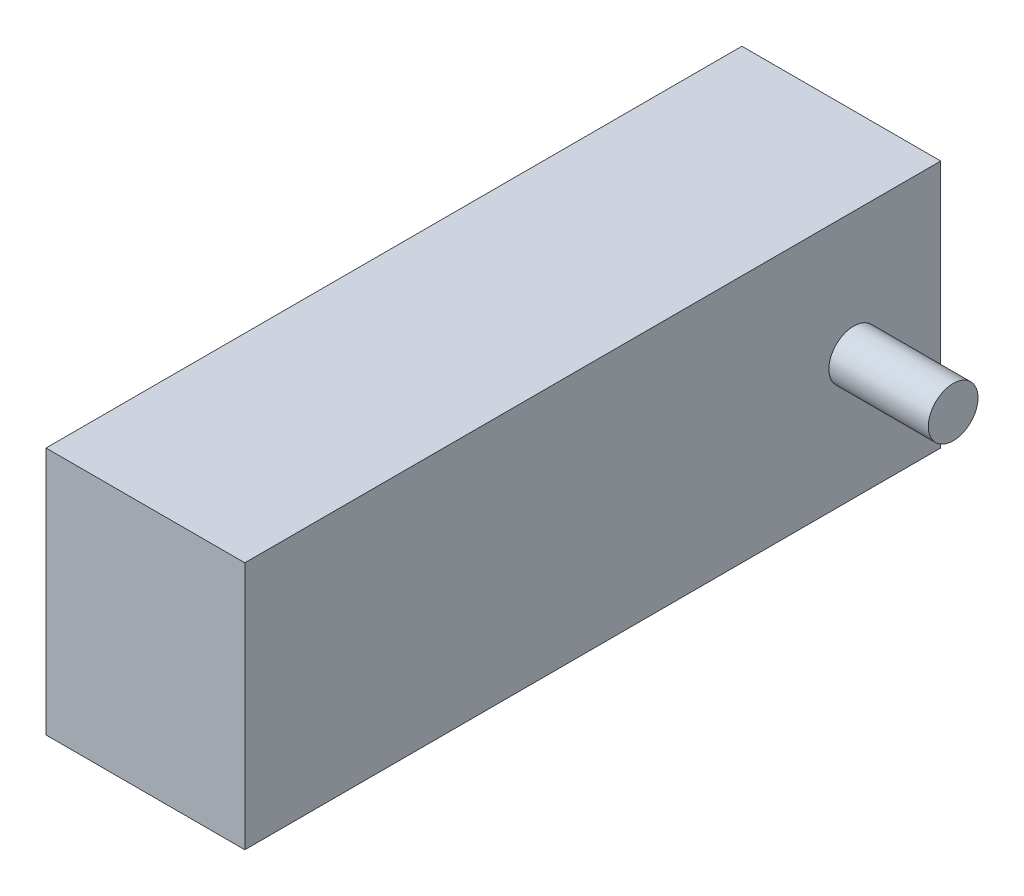
ISO-10303-21;
HEADER;
FILE_DESCRIPTION(('STEP AP214'),'2;1');
FILE_NAME('part.step','',(''),(''),'','','');
FILE_SCHEMA(('AUTOMOTIVE_DESIGN { 1 0 10303 214 1 1 1 1 }'));
ENDSEC;
DATA;
#1=APPLICATION_CONTEXT('core data for automotive mechanical design processes');
#2=APPLICATION_PROTOCOL_DEFINITION('international standard','automotive_design',2000,#1);
#3=PRODUCT_CONTEXT('',#1,'mechanical');
#4=PRODUCT('Part','Part','',(#3));
#5=PRODUCT_RELATED_PRODUCT_CATEGORY('part','',(#4));
#6=PRODUCT_DEFINITION_FORMATION('','',#4);
#7=PRODUCT_DEFINITION_CONTEXT('part definition',#1,'design');
#8=PRODUCT_DEFINITION('design','',#6,#7);
#9=PRODUCT_DEFINITION_SHAPE('','',#8);
#10=(LENGTH_UNIT() NAMED_UNIT(*) SI_UNIT(.MILLI.,.METRE.));
#11=(NAMED_UNIT(*) PLANE_ANGLE_UNIT() SI_UNIT($,.RADIAN.));
#12=(NAMED_UNIT(*) SI_UNIT($,.STERADIAN.) SOLID_ANGLE_UNIT());
#13=UNCERTAINTY_MEASURE_WITH_UNIT(LENGTH_MEASURE(1.E-05),#10,'distance_accuracy_value','');
#14=(GEOMETRIC_REPRESENTATION_CONTEXT(3) GLOBAL_UNCERTAINTY_ASSIGNED_CONTEXT((#13)) GLOBAL_UNIT_ASSIGNED_CONTEXT((#10,
#11,#12)) REPRESENTATION_CONTEXT('',''));
#15=CARTESIAN_POINT('',(0.,0.,0.));
#16=DIRECTION('',(0.,0.,1.));
#17=DIRECTION('',(1.,0.,0.));
#18=AXIS2_PLACEMENT_3D('',#15,#16,#17);
#19=CARTESIAN_POINT('',(0.,25.,0.));
#20=DIRECTION('',(-1.,0.,0.));
#21=DIRECTION('',(0.,0.,1.));
#22=AXIS2_PLACEMENT_3D('',#19,#20,#21);
#23=PLANE('',#22);
#24=CARTESIAN_POINT('',(0.,12.5,-61.25));
#25=DIRECTION('',(-1.,0.,0.));
#26=DIRECTION('',(0.,0.,1.));
#27=AXIS2_PLACEMENT_3D('',#24,#25,#26);
#28=CIRCLE('',#27,2.5);
#29=CARTESIAN_POINT('',(0.,12.5,-58.75));
#30=VERTEX_POINT('',#29);
#31=EDGE_CURVE('E103',#30,#30,#28,.T.);
#32=ORIENTED_EDGE('',*,*,#31,.T.);
#33=EDGE_LOOP('',(#32));
#34=FACE_BOUND('',#33,.T.);
#35=DIRECTION('',(0.,0.,-1.));
#36=VECTOR('',#35,1.);
#37=CARTESIAN_POINT('',(0.,0.,0.));
#38=LINE('',#37,#36);
#39=CARTESIAN_POINT('',(0.,0.,0.));
#40=VERTEX_POINT('',#39);
#41=CARTESIAN_POINT('',(0.,0.,-70.));
#42=VERTEX_POINT('',#41);
#43=EDGE_CURVE('E100',#40,#42,#38,.T.);
#44=ORIENTED_EDGE('',*,*,#43,.T.);
#45=DIRECTION('',(0.,-1.,0.));
#46=VECTOR('',#45,1.);
#47=CARTESIAN_POINT('',(0.,25.,-70.));
#48=LINE('',#47,#46);
#49=CARTESIAN_POINT('',(0.,25.,-70.));
#50=VERTEX_POINT('',#49);
#51=EDGE_CURVE('E11',#50,#42,#48,.T.);
#52=ORIENTED_EDGE('',*,*,#51,.F.);
#53=DIRECTION('',(0.,0.,-1.));
#54=VECTOR('',#53,1.);
#55=CARTESIAN_POINT('',(0.,25.,0.));
#56=LINE('',#55,#54);
#57=CARTESIAN_POINT('',(0.,25.,0.));
#58=VERTEX_POINT('',#57);
#59=EDGE_CURVE('E87',#58,#50,#56,.T.);
#60=ORIENTED_EDGE('',*,*,#59,.F.);
#61=DIRECTION('',(0.,-1.,0.));
#62=VECTOR('',#61,1.);
#63=CARTESIAN_POINT('',(0.,25.,0.));
#64=LINE('',#63,#62);
#65=EDGE_CURVE('E96',#58,#40,#64,.T.);
#66=ORIENTED_EDGE('',*,*,#65,.T.);
#67=EDGE_LOOP('',(#44,#52,#60,#66));
#68=FACE_BOUND('',#67,.T.);
#69=ADVANCED_FACE('F35',(#34,#68),#23,.F.);
#70=CARTESIAN_POINT('',(0.,25.,-70.));
#71=DIRECTION('',(0.,0.,1.));
#72=DIRECTION('',(1.,0.,0.));
#73=AXIS2_PLACEMENT_3D('',#70,#71,#72);
#74=PLANE('',#73);
#75=DIRECTION('',(-1.,0.,0.));
#76=VECTOR('',#75,1.);
#77=CARTESIAN_POINT('',(0.,0.,-70.));
#78=LINE('',#77,#76);
#79=CARTESIAN_POINT('',(-20.,0.,-70.));
#80=VERTEX_POINT('',#79);
#81=EDGE_CURVE('E91',#42,#80,#78,.T.);
#82=ORIENTED_EDGE('',*,*,#81,.T.);
#83=DIRECTION('',(0.,-1.,0.));
#84=VECTOR('',#83,1.);
#85=CARTESIAN_POINT('',(-20.,25.,-70.));
#86=LINE('',#85,#84);
#87=CARTESIAN_POINT('',(-20.,25.,-70.));
#88=VERTEX_POINT('',#87);
#89=EDGE_CURVE('E44',#88,#80,#86,.T.);
#90=ORIENTED_EDGE('',*,*,#89,.F.);
#91=DIRECTION('',(-1.,0.,0.));
#92=VECTOR('',#91,1.);
#93=CARTESIAN_POINT('',(0.,25.,-70.));
#94=LINE('',#93,#92);
#95=EDGE_CURVE('E82',#50,#88,#94,.T.);
#96=ORIENTED_EDGE('',*,*,#95,.F.);
#97=ORIENTED_EDGE('',*,*,#51,.T.);
#98=EDGE_LOOP('',(#82,#90,#96,#97));
#99=FACE_BOUND('',#98,.T.);
#100=ADVANCED_FACE('F90',(#99),#74,.F.);
#101=CARTESIAN_POINT('',(-20.,25.,0.));
#102=DIRECTION('',(1.,0.,0.));
#103=DIRECTION('',(0.,0.,-1.));
#104=AXIS2_PLACEMENT_3D('',#101,#102,#103);
#105=PLANE('',#104);
#106=CARTESIAN_POINT('',(-20.,12.5,-61.25));
#107=DIRECTION('',(1.,0.,0.));
#108=DIRECTION('',(0.,0.,-1.));
#109=AXIS2_PLACEMENT_3D('',#106,#107,#108);
#110=CIRCLE('',#109,2.5);
#111=CARTESIAN_POINT('',(-20.,12.5,-63.75));
#112=VERTEX_POINT('',#111);
#113=EDGE_CURVE('E38',#112,#112,#110,.T.);
#114=ORIENTED_EDGE('',*,*,#113,.T.);
#115=EDGE_LOOP('',(#114));
#116=FACE_BOUND('',#115,.T.);
#117=DIRECTION('',(0.,0.,1.));
#118=VECTOR('',#117,1.);
#119=CARTESIAN_POINT('',(-20.,0.,0.));
#120=LINE('',#119,#118);
#121=CARTESIAN_POINT('',(-20.,0.,0.));
#122=VERTEX_POINT('',#121);
#123=EDGE_CURVE('E69',#80,#122,#120,.T.);
#124=ORIENTED_EDGE('',*,*,#123,.T.);
#125=DIRECTION('',(0.,-1.,0.));
#126=VECTOR('',#125,1.);
#127=CARTESIAN_POINT('',(-20.,25.,0.));
#128=LINE('',#127,#126);
#129=CARTESIAN_POINT('',(-20.,25.,0.));
#130=VERTEX_POINT('',#129);
#131=EDGE_CURVE('E92',#130,#122,#128,.T.);
#132=ORIENTED_EDGE('',*,*,#131,.F.);
#133=DIRECTION('',(0.,0.,1.));
#134=VECTOR('',#133,1.);
#135=CARTESIAN_POINT('',(-20.,25.,0.));
#136=LINE('',#135,#134);
#137=EDGE_CURVE('E85',#88,#130,#136,.T.);
#138=ORIENTED_EDGE('',*,*,#137,.F.);
#139=ORIENTED_EDGE('',*,*,#89,.T.);
#140=EDGE_LOOP('',(#124,#132,#138,#139));
#141=FACE_BOUND('',#140,.T.);
#142=ADVANCED_FACE('F94',(#116,#141),#105,.F.);
#143=CARTESIAN_POINT('',(0.,25.,0.));
#144=DIRECTION('',(0.,0.,-1.));
#145=DIRECTION('',(-1.,0.,0.));
#146=AXIS2_PLACEMENT_3D('',#143,#144,#145);
#147=PLANE('',#146);
#148=DIRECTION('',(1.,0.,0.));
#149=VECTOR('',#148,1.);
#150=CARTESIAN_POINT('',(0.,0.,0.));
#151=LINE('',#150,#149);
#152=EDGE_CURVE('E75',#122,#40,#151,.T.);
#153=ORIENTED_EDGE('',*,*,#152,.T.);
#154=ORIENTED_EDGE('',*,*,#65,.F.);
#155=DIRECTION('',(1.,0.,0.));
#156=VECTOR('',#155,1.);
#157=CARTESIAN_POINT('',(0.,25.,0.));
#158=LINE('',#157,#156);
#159=EDGE_CURVE('E52',#130,#58,#158,.T.);
#160=ORIENTED_EDGE('',*,*,#159,.F.);
#161=ORIENTED_EDGE('',*,*,#131,.T.);
#162=EDGE_LOOP('',(#153,#154,#160,#161));
#163=FACE_BOUND('',#162,.T.);
#164=ADVANCED_FACE('F108',(#163),#147,.F.);
#165=CARTESIAN_POINT('',(0.,25.,0.));
#166=DIRECTION('',(0.,1.,0.));
#167=DIRECTION('',(0.,0.,1.));
#168=AXIS2_PLACEMENT_3D('',#165,#166,#167);
#169=PLANE('',#168);
#170=ORIENTED_EDGE('',*,*,#59,.T.);
#171=ORIENTED_EDGE('',*,*,#95,.T.);
#172=ORIENTED_EDGE('',*,*,#137,.T.);
#173=ORIENTED_EDGE('',*,*,#159,.T.);
#174=EDGE_LOOP('',(#170,#171,#172,#173));
#175=FACE_BOUND('',#174,.T.);
#176=ADVANCED_FACE('F83',(#175),#169,.T.);
#177=CARTESIAN_POINT('',(0.,0.,0.));
#178=DIRECTION('',(0.,1.,0.));
#179=DIRECTION('',(0.,0.,1.));
#180=AXIS2_PLACEMENT_3D('',#177,#178,#179);
#181=PLANE('',#180);
#182=ORIENTED_EDGE('',*,*,#43,.F.);
#183=ORIENTED_EDGE('',*,*,#152,.F.);
#184=ORIENTED_EDGE('',*,*,#123,.F.);
#185=ORIENTED_EDGE('',*,*,#81,.F.);
#186=EDGE_LOOP('',(#182,#183,#184,#185));
#187=FACE_BOUND('',#186,.T.);
#188=ADVANCED_FACE('F111',(#187),#181,.F.);
#189=CARTESIAN_POINT('',(-30.,12.5,-61.25));
#190=DIRECTION('',(1.,0.,0.));
#191=DIRECTION('',(0.,0.,-1.));
#192=AXIS2_PLACEMENT_3D('',#189,#190,#191);
#193=PLANE('',#192);
#194=CARTESIAN_POINT('',(-30.,12.5,-61.25));
#195=DIRECTION('',(1.,0.,0.));
#196=DIRECTION('',(0.,0.,-1.));
#197=AXIS2_PLACEMENT_3D('',#194,#195,#196);
#198=CIRCLE('',#197,2.5);
#199=CARTESIAN_POINT('',(-30.,12.5,-63.75));
#200=VERTEX_POINT('',#199);
#201=EDGE_CURVE('E116',#200,#200,#198,.T.);
#202=ORIENTED_EDGE('',*,*,#201,.F.);
#203=EDGE_LOOP('',(#202));
#204=FACE_BOUND('',#203,.T.);
#205=ADVANCED_FACE('F146',(#204),#193,.F.);
#206=CARTESIAN_POINT('',(-30.,12.5,-61.25));
#207=DIRECTION('',(1.,0.,0.));
#208=DIRECTION('',(0.,0.,-1.));
#209=AXIS2_PLACEMENT_3D('',#206,#207,#208);
#210=CYLINDRICAL_SURFACE('',#209,2.5);
#211=ORIENTED_EDGE('',*,*,#201,.T.);
#212=EDGE_LOOP('',(#211));
#213=FACE_BOUND('',#212,.T.);
#214=ORIENTED_EDGE('',*,*,#113,.F.);
#215=EDGE_LOOP('',(#214));
#216=FACE_BOUND('',#215,.T.);
#217=ADVANCED_FACE('F128',(#213,#216),#210,.T.);
#218=CARTESIAN_POINT('',(10.,12.5,-61.25));
#219=DIRECTION('',(1.,0.,0.));
#220=DIRECTION('',(0.,0.,-1.));
#221=AXIS2_PLACEMENT_3D('',#218,#219,#220);
#222=CIRCLE('',#221,2.5);
#223=CARTESIAN_POINT('',(10.,12.5,-63.75));
#224=VERTEX_POINT('',#223);
#225=EDGE_CURVE('E119',#224,#224,#222,.T.);
#226=ORIENTED_EDGE('',*,*,#225,.F.);
#227=EDGE_LOOP('',(#226));
#228=FACE_BOUND('',#227,.T.);
#229=ORIENTED_EDGE('',*,*,#31,.F.);
#230=EDGE_LOOP('',(#229));
#231=FACE_BOUND('',#230,.T.);
#232=ADVANCED_FACE('F125',(#228,#231),#210,.T.);
#233=CARTESIAN_POINT('',(10.,12.5,-61.25));
#234=DIRECTION('',(1.,0.,0.));
#235=DIRECTION('',(0.,0.,-1.));
#236=AXIS2_PLACEMENT_3D('',#233,#234,#235);
#237=PLANE('',#236);
#238=ORIENTED_EDGE('',*,*,#225,.T.);
#239=EDGE_LOOP('',(#238));
#240=FACE_BOUND('',#239,.T.);
#241=ADVANCED_FACE('F123',(#240),#237,.T.);
#242=CLOSED_SHELL('',(#69,#100,#142,#164,#176,#188,#205,#217,#232,#241));
#243=MANIFOLD_SOLID_BREP('B2',#242);
#244=ADVANCED_BREP_SHAPE_REPRESENTATION('',(#18,#243),#14);
#245=SHAPE_DEFINITION_REPRESENTATION(#9,#244);
ENDSEC;
END-ISO-10303-21;
